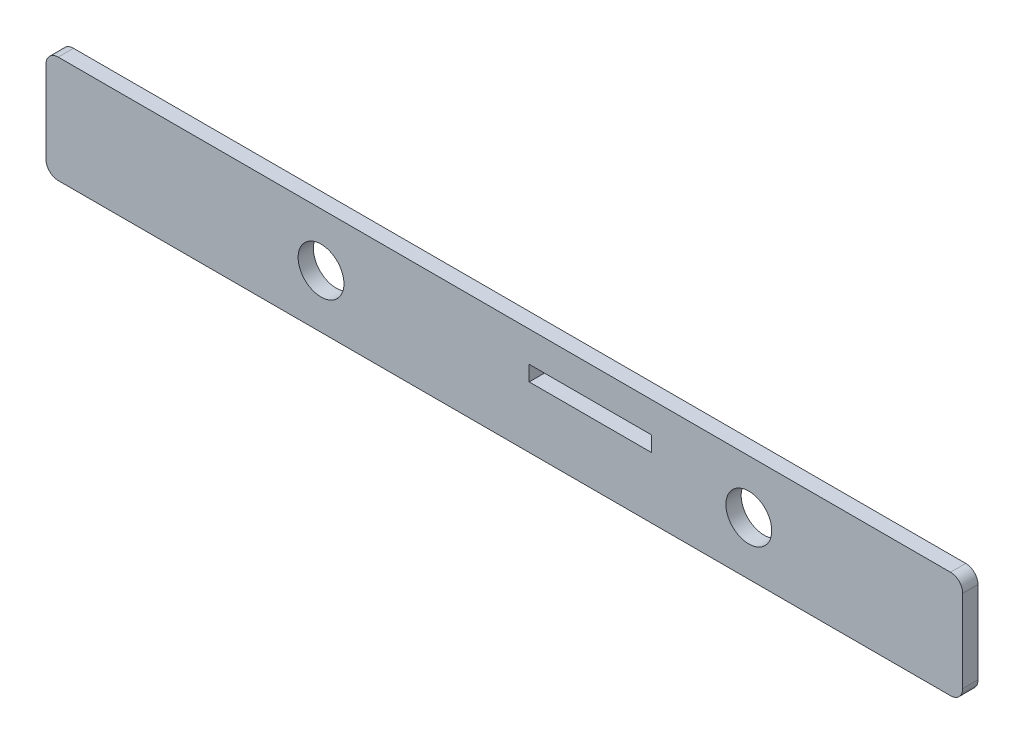
ISO-10303-21;
HEADER;
FILE_DESCRIPTION(('STEP AP214'),'2;1');
FILE_NAME('part.step','',(''),(''),'','','');
FILE_SCHEMA(('AUTOMOTIVE_DESIGN { 1 0 10303 214 1 1 1 1 }'));
ENDSEC;
DATA;
#1=APPLICATION_CONTEXT('core data for automotive mechanical design processes');
#2=APPLICATION_PROTOCOL_DEFINITION('international standard','automotive_design',2000,#1);
#3=PRODUCT_CONTEXT('',#1,'mechanical');
#4=PRODUCT('Part','Part','',(#3));
#5=PRODUCT_RELATED_PRODUCT_CATEGORY('part','',(#4));
#6=PRODUCT_DEFINITION_FORMATION('','',#4);
#7=PRODUCT_DEFINITION_CONTEXT('part definition',#1,'design');
#8=PRODUCT_DEFINITION('design','',#6,#7);
#9=PRODUCT_DEFINITION_SHAPE('','',#8);
#10=(LENGTH_UNIT() NAMED_UNIT(*) SI_UNIT(.MILLI.,.METRE.));
#11=(NAMED_UNIT(*) PLANE_ANGLE_UNIT() SI_UNIT($,.RADIAN.));
#12=(NAMED_UNIT(*) SI_UNIT($,.STERADIAN.) SOLID_ANGLE_UNIT());
#13=UNCERTAINTY_MEASURE_WITH_UNIT(LENGTH_MEASURE(1.E-05),#10,'distance_accuracy_value','');
#14=(GEOMETRIC_REPRESENTATION_CONTEXT(3) GLOBAL_UNCERTAINTY_ASSIGNED_CONTEXT((#13)) GLOBAL_UNIT_ASSIGNED_CONTEXT((#10,
#11,#12)) REPRESENTATION_CONTEXT('',''));
#15=CARTESIAN_POINT('',(0.,0.,0.));
#16=DIRECTION('',(0.,0.,1.));
#17=DIRECTION('',(1.,0.,0.));
#18=AXIS2_PLACEMENT_3D('',#15,#16,#17);
#19=CARTESIAN_POINT('',(0.,0.,6.35));
#20=DIRECTION('',(0.,0.,1.));
#21=DIRECTION('',(1.,0.,0.));
#22=AXIS2_PLACEMENT_3D('',#19,#20,#21);
#23=PLANE('',#22);
#24=CARTESIAN_POINT('',(1219.2,-50.8,6.35));
#25=DIRECTION('',(0.,0.,1.));
#26=DIRECTION('',(1.,0.,0.));
#27=AXIS2_PLACEMENT_3D('',#24,#25,#26);
#28=CIRCLE('',#27,9.52500000000002);
#29=CARTESIAN_POINT('',(1228.725,-50.8,6.35));
#30=VERTEX_POINT('',#29);
#31=EDGE_CURVE('E166',#30,#30,#28,.T.);
#32=ORIENTED_EDGE('',*,*,#31,.F.);
#33=EDGE_LOOP('',(#32));
#34=FACE_BOUND('',#33,.T.);
#35=DIRECTION('',(1.,0.,0.));
#36=VECTOR('',#35,1.);
#37=CARTESIAN_POINT('',(1104.9,-73.025,6.35));
#38=LINE('',#37,#36);
#39=CARTESIAN_POINT('',(1109.98,-73.025,6.35));
#40=VERTEX_POINT('',#39);
#41=CARTESIAN_POINT('',(1480.82,-73.025,6.35));
#42=VERTEX_POINT('',#41);
#43=EDGE_CURVE('E175',#40,#42,#38,.T.);
#44=ORIENTED_EDGE('',*,*,#43,.T.);
#45=CARTESIAN_POINT('',(1480.82,-67.945,6.35));
#46=DIRECTION('',(0.,0.,1.));
#47=DIRECTION('',(1.,0.,0.));
#48=AXIS2_PLACEMENT_3D('',#45,#46,#47);
#49=CIRCLE('',#48,5.08);
#50=CARTESIAN_POINT('',(1485.9,-67.945,6.35));
#51=VERTEX_POINT('',#50);
#52=EDGE_CURVE('E219',#42,#51,#49,.T.);
#53=ORIENTED_EDGE('',*,*,#52,.T.);
#54=DIRECTION('',(0.,1.,0.));
#55=VECTOR('',#54,1.);
#56=CARTESIAN_POINT('',(1485.9,-28.575,6.35));
#57=LINE('',#56,#55);
#58=CARTESIAN_POINT('',(1485.9,-33.655,6.35));
#59=VERTEX_POINT('',#58);
#60=EDGE_CURVE('E179',#51,#59,#57,.T.);
#61=ORIENTED_EDGE('',*,*,#60,.T.);
#62=CARTESIAN_POINT('',(1480.82,-33.655,6.35));
#63=DIRECTION('',(0.,0.,1.));
#64=DIRECTION('',(1.,0.,0.));
#65=AXIS2_PLACEMENT_3D('',#62,#63,#64);
#66=CIRCLE('',#65,5.08);
#67=CARTESIAN_POINT('',(1480.82,-28.575,6.35));
#68=VERTEX_POINT('',#67);
#69=EDGE_CURVE('E217',#59,#68,#66,.T.);
#70=ORIENTED_EDGE('',*,*,#69,.T.);
#71=DIRECTION('',(-1.,0.,0.));
#72=VECTOR('',#71,1.);
#73=CARTESIAN_POINT('',(1104.9,-28.575,6.35));
#74=LINE('',#73,#72);
#75=CARTESIAN_POINT('',(1109.98,-28.575,6.35));
#76=VERTEX_POINT('',#75);
#77=EDGE_CURVE('E182',#68,#76,#74,.T.);
#78=ORIENTED_EDGE('',*,*,#77,.T.);
#79=CARTESIAN_POINT('',(1109.98,-33.655,6.35));
#80=DIRECTION('',(0.,0.,1.));
#81=DIRECTION('',(1.,0.,0.));
#82=AXIS2_PLACEMENT_3D('',#79,#80,#81);
#83=CIRCLE('',#82,5.08);
#84=CARTESIAN_POINT('',(1104.9,-33.655,6.35));
#85=VERTEX_POINT('',#84);
#86=EDGE_CURVE('E213',#76,#85,#83,.T.);
#87=ORIENTED_EDGE('',*,*,#86,.T.);
#88=DIRECTION('',(0.,-1.,0.));
#89=VECTOR('',#88,1.);
#90=CARTESIAN_POINT('',(1104.9,-28.575,6.35));
#91=LINE('',#90,#89);
#92=CARTESIAN_POINT('',(1104.9,-67.945,6.35));
#93=VERTEX_POINT('',#92);
#94=EDGE_CURVE('E172',#85,#93,#91,.T.);
#95=ORIENTED_EDGE('',*,*,#94,.T.);
#96=CARTESIAN_POINT('',(1109.98,-67.945,6.35));
#97=DIRECTION('',(0.,0.,1.));
#98=DIRECTION('',(1.,0.,0.));
#99=AXIS2_PLACEMENT_3D('',#96,#97,#98);
#100=CIRCLE('',#99,5.08);
#101=EDGE_CURVE('E215',#93,#40,#100,.T.);
#102=ORIENTED_EDGE('',*,*,#101,.T.);
#103=EDGE_LOOP('',(#44,#53,#61,#70,#78,#87,#95,#102));
#104=FACE_BOUND('',#103,.T.);
#105=CARTESIAN_POINT('',(1397.,-50.8,6.35));
#106=DIRECTION('',(0.,0.,1.));
#107=DIRECTION('',(1.,0.,0.));
#108=AXIS2_PLACEMENT_3D('',#105,#106,#107);
#109=CIRCLE('',#108,9.52500000000002);
#110=CARTESIAN_POINT('',(1406.525,-50.8,6.35));
#111=VERTEX_POINT('',#110);
#112=EDGE_CURVE('E160',#111,#111,#109,.T.);
#113=ORIENTED_EDGE('',*,*,#112,.F.);
#114=EDGE_LOOP('',(#113));
#115=FACE_BOUND('',#114,.T.);
#116=DIRECTION('',(1.,0.,0.));
#117=VECTOR('',#116,1.);
#118=CARTESIAN_POINT('',(0.,-41.275,6.35));
#119=LINE('',#118,#117);
#120=CARTESIAN_POINT('',(1305.71875,-41.275,6.35));
#121=VERTEX_POINT('',#120);
#122=CARTESIAN_POINT('',(1356.51875,-41.275,6.35));
#123=VERTEX_POINT('',#122);
#124=EDGE_CURVE('E150',#121,#123,#119,.T.);
#125=ORIENTED_EDGE('',*,*,#124,.T.);
#126=DIRECTION('',(0.,-1.,0.));
#127=VECTOR('',#126,1.);
#128=CARTESIAN_POINT('',(1356.51875,0.,6.35));
#129=LINE('',#128,#127);
#130=CARTESIAN_POINT('',(1356.51875,-47.625,6.35));
#131=VERTEX_POINT('',#130);
#132=EDGE_CURVE('E51',#123,#131,#129,.T.);
#133=ORIENTED_EDGE('',*,*,#132,.T.);
#134=DIRECTION('',(1.,0.,0.));
#135=VECTOR('',#134,1.);
#136=CARTESIAN_POINT('',(0.,-47.625,6.35));
#137=LINE('',#136,#135);
#138=CARTESIAN_POINT('',(1305.71875,-47.625,6.35));
#139=VERTEX_POINT('',#138);
#140=EDGE_CURVE('E141',#139,#131,#137,.T.);
#141=ORIENTED_EDGE('',*,*,#140,.F.);
#142=DIRECTION('',(0.,-1.,0.));
#143=VECTOR('',#142,1.);
#144=CARTESIAN_POINT('',(1305.71875,0.,6.35));
#145=LINE('',#144,#143);
#146=EDGE_CURVE('E144',#121,#139,#145,.T.);
#147=ORIENTED_EDGE('',*,*,#146,.F.);
#148=EDGE_LOOP('',(#125,#133,#141,#147));
#149=FACE_BOUND('',#148,.T.);
#150=ADVANCED_FACE('F36',(#34,#104,#115,#149),#23,.T.);
#151=CARTESIAN_POINT('',(0.,0.,0.));
#152=DIRECTION('',(0.,0.,1.));
#153=DIRECTION('',(1.,0.,0.));
#154=AXIS2_PLACEMENT_3D('',#151,#152,#153);
#155=PLANE('',#154);
#156=CARTESIAN_POINT('',(1397.,-50.8,0.));
#157=DIRECTION('',(0.,0.,1.));
#158=DIRECTION('',(1.,0.,0.));
#159=AXIS2_PLACEMENT_3D('',#156,#157,#158);
#160=CIRCLE('',#159,9.52500000000002);
#161=CARTESIAN_POINT('',(1406.525,-50.8,0.));
#162=VERTEX_POINT('',#161);
#163=EDGE_CURVE('E156',#162,#162,#160,.T.);
#164=ORIENTED_EDGE('',*,*,#163,.T.);
#165=EDGE_LOOP('',(#164));
#166=FACE_BOUND('',#165,.T.);
#167=CARTESIAN_POINT('',(1219.2,-50.8,0.));
#168=DIRECTION('',(0.,0.,1.));
#169=DIRECTION('',(1.,0.,0.));
#170=AXIS2_PLACEMENT_3D('',#167,#168,#169);
#171=CIRCLE('',#170,9.52500000000002);
#172=CARTESIAN_POINT('',(1228.725,-50.8,0.));
#173=VERTEX_POINT('',#172);
#174=EDGE_CURVE('E163',#173,#173,#171,.T.);
#175=ORIENTED_EDGE('',*,*,#174,.T.);
#176=EDGE_LOOP('',(#175));
#177=FACE_BOUND('',#176,.T.);
#178=DIRECTION('',(0.,1.,0.));
#179=VECTOR('',#178,1.);
#180=CARTESIAN_POINT('',(1485.9,-28.575,0.));
#181=LINE('',#180,#179);
#182=CARTESIAN_POINT('',(1485.9,-67.945,0.));
#183=VERTEX_POINT('',#182);
#184=CARTESIAN_POINT('',(1485.9,-33.655,0.));
#185=VERTEX_POINT('',#184);
#186=EDGE_CURVE('E191',#183,#185,#181,.T.);
#187=ORIENTED_EDGE('',*,*,#186,.F.);
#188=CARTESIAN_POINT('',(1480.82,-67.945,0.));
#189=DIRECTION('',(0.,0.,1.));
#190=DIRECTION('',(1.,0.,0.));
#191=AXIS2_PLACEMENT_3D('',#188,#189,#190);
#192=CIRCLE('',#191,5.08);
#193=CARTESIAN_POINT('',(1480.82,-73.025,0.));
#194=VERTEX_POINT('',#193);
#195=EDGE_CURVE('E206',#183,#194,#192,.F.);
#196=ORIENTED_EDGE('',*,*,#195,.T.);
#197=DIRECTION('',(1.,0.,0.));
#198=VECTOR('',#197,1.);
#199=CARTESIAN_POINT('',(1104.9,-73.025,0.));
#200=LINE('',#199,#198);
#201=CARTESIAN_POINT('',(1109.98,-73.025,0.));
#202=VERTEX_POINT('',#201);
#203=EDGE_CURVE('E188',#202,#194,#200,.T.);
#204=ORIENTED_EDGE('',*,*,#203,.F.);
#205=CARTESIAN_POINT('',(1109.98,-67.945,0.));
#206=DIRECTION('',(0.,0.,1.));
#207=DIRECTION('',(1.,0.,0.));
#208=AXIS2_PLACEMENT_3D('',#205,#206,#207);
#209=CIRCLE('',#208,5.08);
#210=CARTESIAN_POINT('',(1104.9,-67.945,0.));
#211=VERTEX_POINT('',#210);
#212=EDGE_CURVE('E202',#202,#211,#209,.F.);
#213=ORIENTED_EDGE('',*,*,#212,.T.);
#214=DIRECTION('',(0.,-1.,0.));
#215=VECTOR('',#214,1.);
#216=CARTESIAN_POINT('',(1104.9,-28.575,0.));
#217=LINE('',#216,#215);
#218=CARTESIAN_POINT('',(1104.9,-33.655,0.));
#219=VERTEX_POINT('',#218);
#220=EDGE_CURVE('E169',#219,#211,#217,.T.);
#221=ORIENTED_EDGE('',*,*,#220,.F.);
#222=CARTESIAN_POINT('',(1109.98,-33.655,0.));
#223=DIRECTION('',(0.,0.,1.));
#224=DIRECTION('',(1.,0.,0.));
#225=AXIS2_PLACEMENT_3D('',#222,#223,#224);
#226=CIRCLE('',#225,5.08);
#227=CARTESIAN_POINT('',(1109.98,-28.575,0.));
#228=VERTEX_POINT('',#227);
#229=EDGE_CURVE('E200',#219,#228,#226,.F.);
#230=ORIENTED_EDGE('',*,*,#229,.T.);
#231=DIRECTION('',(-1.,0.,0.));
#232=VECTOR('',#231,1.);
#233=CARTESIAN_POINT('',(1104.9,-28.575,0.));
#234=LINE('',#233,#232);
#235=CARTESIAN_POINT('',(1480.82,-28.575,0.));
#236=VERTEX_POINT('',#235);
#237=EDGE_CURVE('E176',#236,#228,#234,.T.);
#238=ORIENTED_EDGE('',*,*,#237,.F.);
#239=CARTESIAN_POINT('',(1480.82,-33.655,0.));
#240=DIRECTION('',(0.,0.,1.));
#241=DIRECTION('',(1.,0.,0.));
#242=AXIS2_PLACEMENT_3D('',#239,#240,#241);
#243=CIRCLE('',#242,5.08);
#244=EDGE_CURVE('E204',#236,#185,#243,.F.);
#245=ORIENTED_EDGE('',*,*,#244,.T.);
#246=EDGE_LOOP('',(#187,#196,#204,#213,#221,#230,#238,#245));
#247=FACE_BOUND('',#246,.T.);
#248=DIRECTION('',(0.,-1.,0.));
#249=VECTOR('',#248,1.);
#250=CARTESIAN_POINT('',(1356.51875,0.,0.));
#251=LINE('',#250,#249);
#252=CARTESIAN_POINT('',(1356.51875,-41.275,0.));
#253=VERTEX_POINT('',#252);
#254=CARTESIAN_POINT('',(1356.51875,-47.625,0.));
#255=VERTEX_POINT('',#254);
#256=EDGE_CURVE('E132',#253,#255,#251,.T.);
#257=ORIENTED_EDGE('',*,*,#256,.F.);
#258=DIRECTION('',(1.,0.,0.));
#259=VECTOR('',#258,1.);
#260=CARTESIAN_POINT('',(0.,-41.275,0.));
#261=LINE('',#260,#259);
#262=CARTESIAN_POINT('',(1305.71875,-41.275,0.));
#263=VERTEX_POINT('',#262);
#264=EDGE_CURVE('E124',#263,#253,#261,.T.);
#265=ORIENTED_EDGE('',*,*,#264,.F.);
#266=DIRECTION('',(0.,-1.,0.));
#267=VECTOR('',#266,1.);
#268=CARTESIAN_POINT('',(1305.71875,0.,0.));
#269=LINE('',#268,#267);
#270=CARTESIAN_POINT('',(1305.71875,-47.625,0.));
#271=VERTEX_POINT('',#270);
#272=EDGE_CURVE('E59',#263,#271,#269,.T.);
#273=ORIENTED_EDGE('',*,*,#272,.T.);
#274=DIRECTION('',(1.,0.,0.));
#275=VECTOR('',#274,1.);
#276=CARTESIAN_POINT('',(0.,-47.625,0.));
#277=LINE('',#276,#275);
#278=EDGE_CURVE('E136',#271,#255,#277,.T.);
#279=ORIENTED_EDGE('',*,*,#278,.T.);
#280=EDGE_LOOP('',(#257,#265,#273,#279));
#281=FACE_BOUND('',#280,.T.);
#282=ADVANCED_FACE('F139',(#166,#177,#247,#281),#155,.F.);
#283=CARTESIAN_POINT('',(1104.9,-28.575,6.35));
#284=DIRECTION('',(1.,0.,0.));
#285=DIRECTION('',(0.,0.,-1.));
#286=AXIS2_PLACEMENT_3D('',#283,#284,#285);
#287=PLANE('',#286);
#288=ORIENTED_EDGE('',*,*,#220,.T.);
#289=DIRECTION('',(0.,0.,-1.));
#290=VECTOR('',#289,1.);
#291=CARTESIAN_POINT('',(1104.9,-67.945,6.35));
#292=LINE('',#291,#290);
#293=EDGE_CURVE('E11',#211,#93,#292,.F.);
#294=ORIENTED_EDGE('',*,*,#293,.T.);
#295=ORIENTED_EDGE('',*,*,#94,.F.);
#296=DIRECTION('',(0.,0.,-1.));
#297=VECTOR('',#296,1.);
#298=CARTESIAN_POINT('',(1104.9,-33.655,6.35));
#299=LINE('',#298,#297);
#300=EDGE_CURVE('E44',#85,#219,#299,.T.);
#301=ORIENTED_EDGE('',*,*,#300,.T.);
#302=EDGE_LOOP('',(#288,#294,#295,#301));
#303=FACE_BOUND('',#302,.T.);
#304=ADVANCED_FACE('F230',(#303),#287,.F.);
#305=CARTESIAN_POINT('',(1104.9,-73.025,6.35));
#306=DIRECTION('',(0.,1.,0.));
#307=DIRECTION('',(0.,0.,1.));
#308=AXIS2_PLACEMENT_3D('',#305,#306,#307);
#309=PLANE('',#308);
#310=ORIENTED_EDGE('',*,*,#203,.T.);
#311=DIRECTION('',(0.,0.,-1.));
#312=VECTOR('',#311,1.);
#313=CARTESIAN_POINT('',(1480.82,-73.025,6.35));
#314=LINE('',#313,#312);
#315=EDGE_CURVE('E211',#194,#42,#314,.F.);
#316=ORIENTED_EDGE('',*,*,#315,.T.);
#317=ORIENTED_EDGE('',*,*,#43,.F.);
#318=DIRECTION('',(0.,0.,-1.));
#319=VECTOR('',#318,1.);
#320=CARTESIAN_POINT('',(1109.98,-73.025,6.35));
#321=LINE('',#320,#319);
#322=EDGE_CURVE('E208',#40,#202,#321,.T.);
#323=ORIENTED_EDGE('',*,*,#322,.T.);
#324=EDGE_LOOP('',(#310,#316,#317,#323));
#325=FACE_BOUND('',#324,.T.);
#326=ADVANCED_FACE('F244',(#325),#309,.F.);
#327=CARTESIAN_POINT('',(1485.9,-28.575,6.35));
#328=DIRECTION('',(-1.,0.,0.));
#329=DIRECTION('',(0.,0.,1.));
#330=AXIS2_PLACEMENT_3D('',#327,#328,#329);
#331=PLANE('',#330);
#332=ORIENTED_EDGE('',*,*,#60,.F.);
#333=DIRECTION('',(0.,0.,-1.));
#334=VECTOR('',#333,1.);
#335=CARTESIAN_POINT('',(1485.9,-67.945,6.35));
#336=LINE('',#335,#334);
#337=EDGE_CURVE('E197',#51,#183,#336,.T.);
#338=ORIENTED_EDGE('',*,*,#337,.T.);
#339=ORIENTED_EDGE('',*,*,#186,.T.);
#340=DIRECTION('',(0.,0.,-1.));
#341=VECTOR('',#340,1.);
#342=CARTESIAN_POINT('',(1485.9,-33.655,6.35));
#343=LINE('',#342,#341);
#344=EDGE_CURVE('E185',#185,#59,#343,.F.);
#345=ORIENTED_EDGE('',*,*,#344,.T.);
#346=EDGE_LOOP('',(#332,#338,#339,#345));
#347=FACE_BOUND('',#346,.T.);
#348=ADVANCED_FACE('F254',(#347),#331,.F.);
#349=CARTESIAN_POINT('',(1104.9,-28.575,6.35));
#350=DIRECTION('',(0.,-1.,0.));
#351=DIRECTION('',(0.,0.,-1.));
#352=AXIS2_PLACEMENT_3D('',#349,#350,#351);
#353=PLANE('',#352);
#354=ORIENTED_EDGE('',*,*,#77,.F.);
#355=DIRECTION('',(0.,0.,-1.));
#356=VECTOR('',#355,1.);
#357=CARTESIAN_POINT('',(1480.82,-28.575,6.35));
#358=LINE('',#357,#356);
#359=EDGE_CURVE('E223',#68,#236,#358,.T.);
#360=ORIENTED_EDGE('',*,*,#359,.T.);
#361=ORIENTED_EDGE('',*,*,#237,.T.);
#362=DIRECTION('',(0.,0.,-1.));
#363=VECTOR('',#362,1.);
#364=CARTESIAN_POINT('',(1109.98,-28.575,6.35));
#365=LINE('',#364,#363);
#366=EDGE_CURVE('E221',#228,#76,#365,.F.);
#367=ORIENTED_EDGE('',*,*,#366,.T.);
#368=EDGE_LOOP('',(#354,#360,#361,#367));
#369=FACE_BOUND('',#368,.T.);
#370=ADVANCED_FACE('F262',(#369),#353,.F.);
#371=CARTESIAN_POINT('',(1219.2,-50.8,6.35));
#372=DIRECTION('',(0.,0.,-1.));
#373=DIRECTION('',(-1.,0.,0.));
#374=AXIS2_PLACEMENT_3D('',#371,#372,#373);
#375=CYLINDRICAL_SURFACE('',#374,9.52500000000002);
#376=ORIENTED_EDGE('',*,*,#31,.T.);
#377=EDGE_LOOP('',(#376));
#378=FACE_BOUND('',#377,.T.);
#379=ORIENTED_EDGE('',*,*,#174,.F.);
#380=EDGE_LOOP('',(#379));
#381=FACE_BOUND('',#380,.T.);
#382=ADVANCED_FACE('F281',(#378,#381),#375,.F.);
#383=CARTESIAN_POINT('',(1397.,-50.8,6.35));
#384=DIRECTION('',(0.,0.,-1.));
#385=DIRECTION('',(-1.,0.,0.));
#386=AXIS2_PLACEMENT_3D('',#383,#384,#385);
#387=CYLINDRICAL_SURFACE('',#386,9.52500000000002);
#388=ORIENTED_EDGE('',*,*,#112,.T.);
#389=EDGE_LOOP('',(#388));
#390=FACE_BOUND('',#389,.T.);
#391=ORIENTED_EDGE('',*,*,#163,.F.);
#392=EDGE_LOOP('',(#391));
#393=FACE_BOUND('',#392,.T.);
#394=ADVANCED_FACE('F294',(#390,#393),#387,.F.);
#395=CARTESIAN_POINT('',(1480.82,-67.945,6.35));
#396=DIRECTION('',(0.,0.,-1.));
#397=DIRECTION('',(-1.,0.,0.));
#398=AXIS2_PLACEMENT_3D('',#395,#396,#397);
#399=CYLINDRICAL_SURFACE('',#398,5.08);
#400=ORIENTED_EDGE('',*,*,#52,.F.);
#401=ORIENTED_EDGE('',*,*,#315,.F.);
#402=ORIENTED_EDGE('',*,*,#195,.F.);
#403=ORIENTED_EDGE('',*,*,#337,.F.);
#404=EDGE_LOOP('',(#400,#401,#402,#403));
#405=FACE_BOUND('',#404,.T.);
#406=ADVANCED_FACE('F252',(#405),#399,.T.);
#407=CARTESIAN_POINT('',(1480.82,-33.655,6.35));
#408=DIRECTION('',(0.,0.,-1.));
#409=DIRECTION('',(-1.,0.,0.));
#410=AXIS2_PLACEMENT_3D('',#407,#408,#409);
#411=CYLINDRICAL_SURFACE('',#410,5.08);
#412=ORIENTED_EDGE('',*,*,#69,.F.);
#413=ORIENTED_EDGE('',*,*,#344,.F.);
#414=ORIENTED_EDGE('',*,*,#244,.F.);
#415=ORIENTED_EDGE('',*,*,#359,.F.);
#416=EDGE_LOOP('',(#412,#413,#414,#415));
#417=FACE_BOUND('',#416,.T.);
#418=ADVANCED_FACE('F259',(#417),#411,.T.);
#419=CARTESIAN_POINT('',(1109.98,-67.945,6.35));
#420=DIRECTION('',(0.,0.,-1.));
#421=DIRECTION('',(-1.,0.,0.));
#422=AXIS2_PLACEMENT_3D('',#419,#420,#421);
#423=CYLINDRICAL_SURFACE('',#422,5.08);
#424=ORIENTED_EDGE('',*,*,#101,.F.);
#425=ORIENTED_EDGE('',*,*,#293,.F.);
#426=ORIENTED_EDGE('',*,*,#212,.F.);
#427=ORIENTED_EDGE('',*,*,#322,.F.);
#428=EDGE_LOOP('',(#424,#425,#426,#427));
#429=FACE_BOUND('',#428,.T.);
#430=ADVANCED_FACE('F241',(#429),#423,.T.);
#431=CARTESIAN_POINT('',(1109.98,-33.655,6.35));
#432=DIRECTION('',(0.,0.,-1.));
#433=DIRECTION('',(-1.,0.,0.));
#434=AXIS2_PLACEMENT_3D('',#431,#432,#433);
#435=CYLINDRICAL_SURFACE('',#434,5.08);
#436=ORIENTED_EDGE('',*,*,#86,.F.);
#437=ORIENTED_EDGE('',*,*,#366,.F.);
#438=ORIENTED_EDGE('',*,*,#229,.F.);
#439=ORIENTED_EDGE('',*,*,#300,.F.);
#440=EDGE_LOOP('',(#436,#437,#438,#439));
#441=FACE_BOUND('',#440,.T.);
#442=ADVANCED_FACE('F38',(#441),#435,.T.);
#443=CARTESIAN_POINT('',(1356.51875,0.,0.));
#444=DIRECTION('',(-1.,0.,0.));
#445=DIRECTION('',(0.,0.,1.));
#446=AXIS2_PLACEMENT_3D('',#443,#444,#445);
#447=PLANE('',#446);
#448=ORIENTED_EDGE('',*,*,#132,.F.);
#449=DIRECTION('',(0.,0.,1.));
#450=VECTOR('',#449,1.);
#451=CARTESIAN_POINT('',(1356.51875,-41.275,0.));
#452=LINE('',#451,#450);
#453=EDGE_CURVE('E127',#253,#123,#452,.T.);
#454=ORIENTED_EDGE('',*,*,#453,.F.);
#455=ORIENTED_EDGE('',*,*,#256,.T.);
#456=DIRECTION('',(0.,0.,1.));
#457=VECTOR('',#456,1.);
#458=CARTESIAN_POINT('',(1356.51875,-47.625,0.));
#459=LINE('',#458,#457);
#460=EDGE_CURVE('E154',#255,#131,#459,.T.);
#461=ORIENTED_EDGE('',*,*,#460,.T.);
#462=EDGE_LOOP('',(#448,#454,#455,#461));
#463=FACE_BOUND('',#462,.T.);
#464=ADVANCED_FACE('F134',(#463),#447,.T.);
#465=CARTESIAN_POINT('',(0.,-47.625,0.));
#466=DIRECTION('',(0.,-1.,0.));
#467=DIRECTION('',(0.,0.,-1.));
#468=AXIS2_PLACEMENT_3D('',#465,#466,#467);
#469=PLANE('',#468);
#470=ORIENTED_EDGE('',*,*,#140,.T.);
#471=ORIENTED_EDGE('',*,*,#460,.F.);
#472=ORIENTED_EDGE('',*,*,#278,.F.);
#473=DIRECTION('',(0.,0.,1.));
#474=VECTOR('',#473,1.);
#475=CARTESIAN_POINT('',(1305.71875,-47.625,0.));
#476=LINE('',#475,#474);
#477=EDGE_CURVE('E157',#271,#139,#476,.T.);
#478=ORIENTED_EDGE('',*,*,#477,.T.);
#479=EDGE_LOOP('',(#470,#471,#472,#478));
#480=FACE_BOUND('',#479,.T.);
#481=ADVANCED_FACE('F269',(#480),#469,.F.);
#482=CARTESIAN_POINT('',(1305.71875,0.,0.));
#483=DIRECTION('',(-1.,0.,0.));
#484=DIRECTION('',(0.,0.,1.));
#485=AXIS2_PLACEMENT_3D('',#482,#483,#484);
#486=PLANE('',#485);
#487=ORIENTED_EDGE('',*,*,#146,.T.);
#488=ORIENTED_EDGE('',*,*,#477,.F.);
#489=ORIENTED_EDGE('',*,*,#272,.F.);
#490=DIRECTION('',(0.,0.,1.));
#491=VECTOR('',#490,1.);
#492=CARTESIAN_POINT('',(1305.71875,-41.275,0.));
#493=LINE('',#492,#491);
#494=EDGE_CURVE('E129',#263,#121,#493,.T.);
#495=ORIENTED_EDGE('',*,*,#494,.T.);
#496=EDGE_LOOP('',(#487,#488,#489,#495));
#497=FACE_BOUND('',#496,.T.);
#498=ADVANCED_FACE('F334',(#497),#486,.F.);
#499=CARTESIAN_POINT('',(0.,-41.275,0.));
#500=DIRECTION('',(0.,-1.,0.));
#501=DIRECTION('',(0.,0.,-1.));
#502=AXIS2_PLACEMENT_3D('',#499,#500,#501);
#503=PLANE('',#502);
#504=ORIENTED_EDGE('',*,*,#124,.F.);
#505=ORIENTED_EDGE('',*,*,#494,.F.);
#506=ORIENTED_EDGE('',*,*,#264,.T.);
#507=ORIENTED_EDGE('',*,*,#453,.T.);
#508=EDGE_LOOP('',(#504,#505,#506,#507));
#509=FACE_BOUND('',#508,.T.);
#510=ADVANCED_FACE('F126',(#509),#503,.T.);
#511=CLOSED_SHELL('',(#150,#282,#304,#326,#348,#370,#382,#394,#406,#418,#430,#442,#464,#481,
#498,#510));
#512=MANIFOLD_SOLID_BREP('B2',#511);
#513=ADVANCED_BREP_SHAPE_REPRESENTATION('',(#18,#512),#14);
#514=SHAPE_DEFINITION_REPRESENTATION(#9,#513);
ENDSEC;
END-ISO-10303-21;
